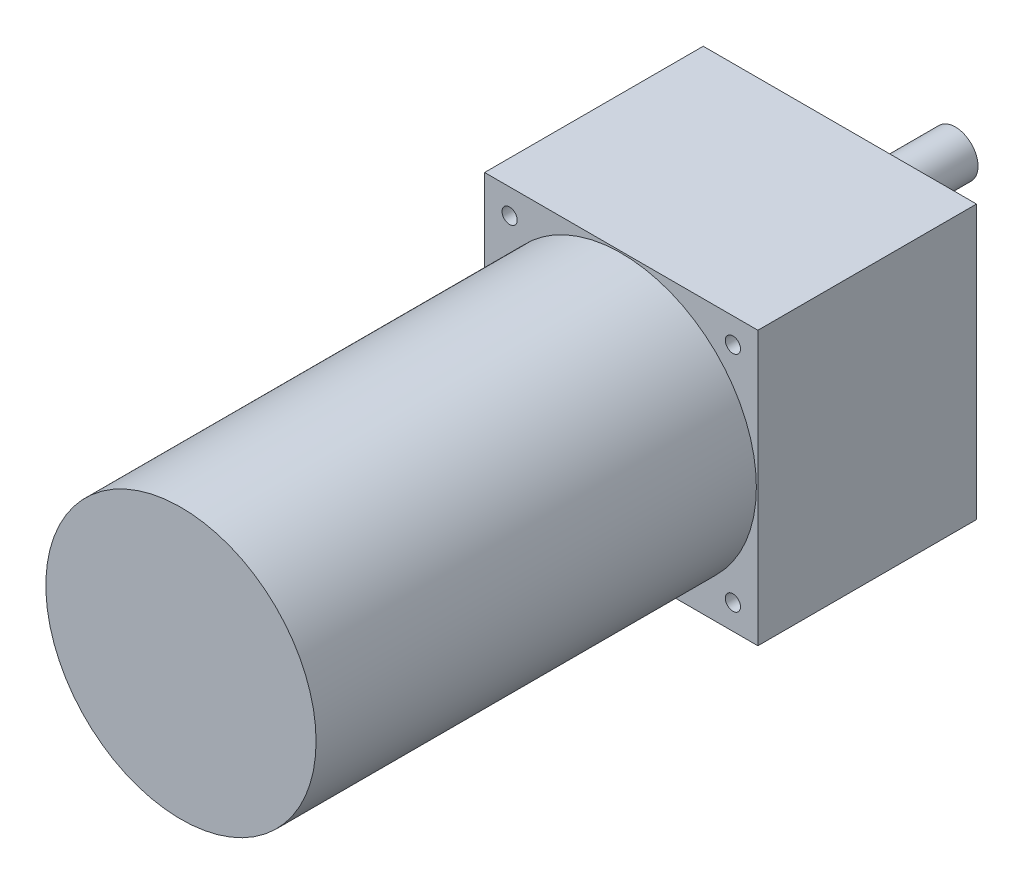
ISO-10303-21;
HEADER;
FILE_DESCRIPTION(('STEP AP214'),'2;1');
FILE_NAME('part.step','',(''),(''),'','','');
FILE_SCHEMA(('AUTOMOTIVE_DESIGN { 1 0 10303 214 1 1 1 1 }'));
ENDSEC;
DATA;
#1=APPLICATION_CONTEXT('core data for automotive mechanical design processes');
#2=APPLICATION_PROTOCOL_DEFINITION('international standard','automotive_design',2000,#1);
#3=PRODUCT_CONTEXT('',#1,'mechanical');
#4=PRODUCT('Part','Part','',(#3));
#5=PRODUCT_RELATED_PRODUCT_CATEGORY('part','',(#4));
#6=PRODUCT_DEFINITION_FORMATION('','',#4);
#7=PRODUCT_DEFINITION_CONTEXT('part definition',#1,'design');
#8=PRODUCT_DEFINITION('design','',#6,#7);
#9=PRODUCT_DEFINITION_SHAPE('','',#8);
#10=(LENGTH_UNIT() NAMED_UNIT(*) SI_UNIT(.MILLI.,.METRE.));
#11=(NAMED_UNIT(*) PLANE_ANGLE_UNIT() SI_UNIT($,.RADIAN.));
#12=(NAMED_UNIT(*) SI_UNIT($,.STERADIAN.) SOLID_ANGLE_UNIT());
#13=UNCERTAINTY_MEASURE_WITH_UNIT(LENGTH_MEASURE(1.E-05),#10,'distance_accuracy_value','');
#14=(GEOMETRIC_REPRESENTATION_CONTEXT(3) GLOBAL_UNCERTAINTY_ASSIGNED_CONTEXT((#13)) GLOBAL_UNIT_ASSIGNED_CONTEXT((#10,
#11,#12)) REPRESENTATION_CONTEXT('',''));
#15=CARTESIAN_POINT('',(0.,0.,0.));
#16=DIRECTION('',(0.,0.,1.));
#17=DIRECTION('',(1.,0.,0.));
#18=AXIS2_PLACEMENT_3D('',#15,#16,#17);
#19=CARTESIAN_POINT('',(45.,45.,7.));
#20=DIRECTION('',(-1.,0.,0.));
#21=DIRECTION('',(0.,-1.,0.));
#22=AXIS2_PLACEMENT_3D('',#19,#20,#21);
#23=PLANE('',#22);
#24=DIRECTION('',(0.,0.,-1.));
#25=VECTOR('',#24,1.);
#26=CARTESIAN_POINT('',(45.,-45.,7.));
#27=LINE('',#26,#25);
#28=CARTESIAN_POINT('',(45.,-45.,7.));
#29=VERTEX_POINT('',#28);
#30=CARTESIAN_POINT('',(45.,-45.,-65.));
#31=VERTEX_POINT('',#30);
#32=EDGE_CURVE('E120',#29,#31,#27,.T.);
#33=ORIENTED_EDGE('',*,*,#32,.T.);
#34=DIRECTION('',(0.,-1.,0.));
#35=VECTOR('',#34,1.);
#36=CARTESIAN_POINT('',(45.,45.,-65.));
#37=LINE('',#36,#35);
#38=CARTESIAN_POINT('',(45.,45.,-65.));
#39=VERTEX_POINT('',#38);
#40=EDGE_CURVE('E96',#39,#31,#37,.T.);
#41=ORIENTED_EDGE('',*,*,#40,.F.);
#42=DIRECTION('',(0.,0.,-1.));
#43=VECTOR('',#42,1.);
#44=CARTESIAN_POINT('',(45.,45.,7.));
#45=LINE('',#44,#43);
#46=CARTESIAN_POINT('',(45.,45.,7.));
#47=VERTEX_POINT('',#46);
#48=EDGE_CURVE('E47',#47,#39,#45,.T.);
#49=ORIENTED_EDGE('',*,*,#48,.F.);
#50=DIRECTION('',(0.,1.,0.));
#51=VECTOR('',#50,1.);
#52=CARTESIAN_POINT('',(45.,45.,7.));
#53=LINE('',#52,#51);
#54=EDGE_CURVE('E113',#29,#47,#53,.T.);
#55=ORIENTED_EDGE('',*,*,#54,.F.);
#56=EDGE_LOOP('',(#33,#41,#49,#55));
#57=FACE_BOUND('',#56,.T.);
#58=ADVANCED_FACE('F39',(#57),#23,.F.);
#59=CARTESIAN_POINT('',(-45.,45.,7.));
#60=DIRECTION('',(0.,-1.,0.));
#61=DIRECTION('',(0.,0.,-1.));
#62=AXIS2_PLACEMENT_3D('',#59,#60,#61);
#63=PLANE('',#62);
#64=ORIENTED_EDGE('',*,*,#48,.T.);
#65=DIRECTION('',(1.,0.,0.));
#66=VECTOR('',#65,1.);
#67=CARTESIAN_POINT('',(45.,45.,-65.));
#68=LINE('',#67,#66);
#69=CARTESIAN_POINT('',(-45.,45.,-65.));
#70=VERTEX_POINT('',#69);
#71=EDGE_CURVE('E90',#70,#39,#68,.T.);
#72=ORIENTED_EDGE('',*,*,#71,.F.);
#73=DIRECTION('',(0.,0.,-1.));
#74=VECTOR('',#73,1.);
#75=CARTESIAN_POINT('',(-45.,45.,7.));
#76=LINE('',#75,#74);
#77=CARTESIAN_POINT('',(-45.,45.,7.));
#78=VERTEX_POINT('',#77);
#79=EDGE_CURVE('E81',#78,#70,#76,.T.);
#80=ORIENTED_EDGE('',*,*,#79,.F.);
#81=DIRECTION('',(-1.,0.,0.));
#82=VECTOR('',#81,1.);
#83=CARTESIAN_POINT('',(-45.,45.,7.));
#84=LINE('',#83,#82);
#85=EDGE_CURVE('E116',#47,#78,#84,.T.);
#86=ORIENTED_EDGE('',*,*,#85,.F.);
#87=EDGE_LOOP('',(#64,#72,#80,#86));
#88=FACE_BOUND('',#87,.T.);
#89=ADVANCED_FACE('F91',(#88),#63,.F.);
#90=CARTESIAN_POINT('',(-45.,45.,7.));
#91=DIRECTION('',(1.,0.,0.));
#92=DIRECTION('',(0.,1.,0.));
#93=AXIS2_PLACEMENT_3D('',#90,#91,#92);
#94=PLANE('',#93);
#95=ORIENTED_EDGE('',*,*,#79,.T.);
#96=DIRECTION('',(0.,1.,0.));
#97=VECTOR('',#96,1.);
#98=CARTESIAN_POINT('',(-45.,45.,-65.));
#99=LINE('',#98,#97);
#100=CARTESIAN_POINT('',(-45.,-45.,-65.));
#101=VERTEX_POINT('',#100);
#102=EDGE_CURVE('E85',#101,#70,#99,.T.);
#103=ORIENTED_EDGE('',*,*,#102,.F.);
#104=DIRECTION('',(0.,0.,-1.));
#105=VECTOR('',#104,1.);
#106=CARTESIAN_POINT('',(-45.,-45.,7.));
#107=LINE('',#106,#105);
#108=CARTESIAN_POINT('',(-45.,-45.,7.));
#109=VERTEX_POINT('',#108);
#110=EDGE_CURVE('E87',#109,#101,#107,.T.);
#111=ORIENTED_EDGE('',*,*,#110,.F.);
#112=DIRECTION('',(0.,-1.,0.));
#113=VECTOR('',#112,1.);
#114=CARTESIAN_POINT('',(-45.,45.,7.));
#115=LINE('',#114,#113);
#116=EDGE_CURVE('E60',#78,#109,#115,.T.);
#117=ORIENTED_EDGE('',*,*,#116,.F.);
#118=EDGE_LOOP('',(#95,#103,#111,#117));
#119=FACE_BOUND('',#118,.T.);
#120=ADVANCED_FACE('F83',(#119),#94,.F.);
#121=CARTESIAN_POINT('',(-45.,-45.,7.));
#122=DIRECTION('',(0.,1.,0.));
#123=DIRECTION('',(0.,0.,1.));
#124=AXIS2_PLACEMENT_3D('',#121,#122,#123);
#125=PLANE('',#124);
#126=ORIENTED_EDGE('',*,*,#110,.T.);
#127=DIRECTION('',(-1.,0.,0.));
#128=VECTOR('',#127,1.);
#129=CARTESIAN_POINT('',(45.,-45.,-65.));
#130=LINE('',#129,#128);
#131=EDGE_CURVE('E101',#31,#101,#130,.T.);
#132=ORIENTED_EDGE('',*,*,#131,.F.);
#133=ORIENTED_EDGE('',*,*,#32,.F.);
#134=DIRECTION('',(1.,0.,0.));
#135=VECTOR('',#134,1.);
#136=CARTESIAN_POINT('',(-45.,-45.,7.));
#137=LINE('',#136,#135);
#138=EDGE_CURVE('E55',#109,#29,#137,.T.);
#139=ORIENTED_EDGE('',*,*,#138,.F.);
#140=EDGE_LOOP('',(#126,#132,#133,#139));
#141=FACE_BOUND('',#140,.T.);
#142=ADVANCED_FACE('F123',(#141),#125,.F.);
#143=CARTESIAN_POINT('',(0.,0.,7.));
#144=DIRECTION('',(0.,0.,1.));
#145=DIRECTION('',(1.,0.,0.));
#146=AXIS2_PLACEMENT_3D('',#143,#144,#145);
#147=PLANE('',#146);
#148=CARTESIAN_POINT('',(36.7695526217005,36.7695526217004,7.00000000000001));
#149=DIRECTION('',(0.,0.,1.));
#150=DIRECTION('',(1.,0.,0.));
#151=AXIS2_PLACEMENT_3D('',#148,#149,#150);
#152=CIRCLE('',#151,2.49999999999997);
#153=CARTESIAN_POINT('',(39.2695526217005,36.7695526217004,7.00000000000001));
#154=VERTEX_POINT('',#153);
#155=EDGE_CURVE('E299',#154,#154,#152,.T.);
#156=ORIENTED_EDGE('',*,*,#155,.F.);
#157=EDGE_LOOP('',(#156));
#158=FACE_BOUND('',#157,.T.);
#159=CARTESIAN_POINT('',(-36.7695526217005,36.7695526217004,7.00000000000001));
#160=DIRECTION('',(0.,0.,1.));
#161=DIRECTION('',(1.,0.,0.));
#162=AXIS2_PLACEMENT_3D('',#159,#160,#161);
#163=CIRCLE('',#162,2.49999999999997);
#164=CARTESIAN_POINT('',(-34.2695526217006,36.7695526217004,7.00000000000001));
#165=VERTEX_POINT('',#164);
#166=EDGE_CURVE('E42',#165,#165,#163,.T.);
#167=ORIENTED_EDGE('',*,*,#166,.F.);
#168=EDGE_LOOP('',(#167));
#169=FACE_BOUND('',#168,.T.);
#170=CARTESIAN_POINT('',(-36.7695526217008,-36.7695526217001,7.00000000000001));
#171=DIRECTION('',(0.,0.,1.));
#172=DIRECTION('',(1.,0.,0.));
#173=AXIS2_PLACEMENT_3D('',#170,#171,#172);
#174=CIRCLE('',#173,2.49999999999997);
#175=CARTESIAN_POINT('',(-34.2695526217008,-36.7695526217001,7.00000000000001));
#176=VERTEX_POINT('',#175);
#177=EDGE_CURVE('E312',#176,#176,#174,.T.);
#178=ORIENTED_EDGE('',*,*,#177,.F.);
#179=EDGE_LOOP('',(#178));
#180=FACE_BOUND('',#179,.T.);
#181=CARTESIAN_POINT('',(36.7695526217003,-36.7695526217007,7.00000000000001));
#182=DIRECTION('',(0.,0.,1.));
#183=DIRECTION('',(1.,0.,0.));
#184=AXIS2_PLACEMENT_3D('',#181,#182,#183);
#185=CIRCLE('',#184,2.49999999999997);
#186=CARTESIAN_POINT('',(39.2695526217002,-36.7695526217007,7.00000000000001));
#187=VERTEX_POINT('',#186);
#188=EDGE_CURVE('E318',#187,#187,#185,.T.);
#189=ORIENTED_EDGE('',*,*,#188,.F.);
#190=EDGE_LOOP('',(#189));
#191=FACE_BOUND('',#190,.T.);
#192=CARTESIAN_POINT('',(0.,0.,7.));
#193=DIRECTION('',(0.,0.,1.));
#194=DIRECTION('',(1.,0.,0.));
#195=AXIS2_PLACEMENT_3D('',#192,#193,#194);
#196=CIRCLE('',#195,44.5);
#197=CARTESIAN_POINT('',(44.5,0.,7.));
#198=VERTEX_POINT('',#197);
#199=EDGE_CURVE('E11',#198,#198,#196,.T.);
#200=ORIENTED_EDGE('',*,*,#199,.F.);
#201=EDGE_LOOP('',(#200));
#202=FACE_BOUND('',#201,.T.);
#203=ORIENTED_EDGE('',*,*,#54,.T.);
#204=ORIENTED_EDGE('',*,*,#85,.T.);
#205=ORIENTED_EDGE('',*,*,#116,.T.);
#206=ORIENTED_EDGE('',*,*,#138,.T.);
#207=EDGE_LOOP('',(#203,#204,#205,#206));
#208=FACE_BOUND('',#207,.T.);
#209=ADVANCED_FACE('F126',(#158,#169,#180,#191,#202,#208),#147,.T.);
#210=CARTESIAN_POINT('',(0.,0.,152.));
#211=DIRECTION('',(0.,0.,-1.));
#212=DIRECTION('',(-1.,0.,0.));
#213=AXIS2_PLACEMENT_3D('',#210,#211,#212);
#214=CYLINDRICAL_SURFACE('',#213,44.5);
#215=CARTESIAN_POINT('',(0.,0.,152.));
#216=DIRECTION('',(0.,0.,1.));
#217=DIRECTION('',(1.,0.,0.));
#218=AXIS2_PLACEMENT_3D('',#215,#216,#217);
#219=CIRCLE('',#218,44.5);
#220=CARTESIAN_POINT('',(44.5,0.,152.));
#221=VERTEX_POINT('',#220);
#222=EDGE_CURVE('E111',#221,#221,#219,.T.);
#223=ORIENTED_EDGE('',*,*,#222,.F.);
#224=EDGE_LOOP('',(#223));
#225=FACE_BOUND('',#224,.T.);
#226=ORIENTED_EDGE('',*,*,#199,.T.);
#227=EDGE_LOOP('',(#226));
#228=FACE_BOUND('',#227,.T.);
#229=ADVANCED_FACE('F128',(#225,#228),#214,.T.);
#230=CARTESIAN_POINT('',(0.,0.,152.));
#231=DIRECTION('',(0.,0.,1.));
#232=DIRECTION('',(1.,0.,0.));
#233=AXIS2_PLACEMENT_3D('',#230,#231,#232);
#234=PLANE('',#233);
#235=ORIENTED_EDGE('',*,*,#222,.T.);
#236=EDGE_LOOP('',(#235));
#237=FACE_BOUND('',#236,.T.);
#238=ADVANCED_FACE('F135',(#237),#234,.T.);
#239=CARTESIAN_POINT('',(0.,0.,-65.));
#240=DIRECTION('',(0.,0.,-1.));
#241=DIRECTION('',(-1.,0.,0.));
#242=AXIS2_PLACEMENT_3D('',#239,#240,#241);
#243=PLANE('',#242);
#244=CARTESIAN_POINT('',(36.7695526217005,36.7695526217004,-65.));
#245=DIRECTION('',(0.,0.,-1.));
#246=DIRECTION('',(-1.,0.,0.));
#247=AXIS2_PLACEMENT_3D('',#244,#245,#246);
#248=CIRCLE('',#247,2.49999999999999);
#249=CARTESIAN_POINT('',(34.2695526217005,36.7695526217004,-65.));
#250=VERTEX_POINT('',#249);
#251=EDGE_CURVE('E302',#250,#250,#248,.T.);
#252=ORIENTED_EDGE('',*,*,#251,.F.);
#253=EDGE_LOOP('',(#252));
#254=FACE_BOUND('',#253,.T.);
#255=CARTESIAN_POINT('',(-36.7695526217005,36.7695526217004,-65.));
#256=DIRECTION('',(0.,0.,-1.));
#257=DIRECTION('',(-1.,0.,0.));
#258=AXIS2_PLACEMENT_3D('',#255,#256,#257);
#259=CIRCLE('',#258,2.49999999999999);
#260=CARTESIAN_POINT('',(-39.2695526217005,36.7695526217004,-65.));
#261=VERTEX_POINT('',#260);
#262=EDGE_CURVE('E304',#261,#261,#259,.T.);
#263=ORIENTED_EDGE('',*,*,#262,.F.);
#264=EDGE_LOOP('',(#263));
#265=FACE_BOUND('',#264,.T.);
#266=CARTESIAN_POINT('',(-36.7695526217008,-36.7695526217001,-65.));
#267=DIRECTION('',(0.,0.,-1.));
#268=DIRECTION('',(-1.,0.,0.));
#269=AXIS2_PLACEMENT_3D('',#266,#267,#268);
#270=CIRCLE('',#269,2.49999999999999);
#271=CARTESIAN_POINT('',(-39.2695526217008,-36.7695526217001,-65.));
#272=VERTEX_POINT('',#271);
#273=EDGE_CURVE('E309',#272,#272,#270,.T.);
#274=ORIENTED_EDGE('',*,*,#273,.F.);
#275=EDGE_LOOP('',(#274));
#276=FACE_BOUND('',#275,.T.);
#277=CARTESIAN_POINT('',(36.7695526217003,-36.7695526217007,-65.));
#278=DIRECTION('',(0.,0.,-1.));
#279=DIRECTION('',(-1.,0.,0.));
#280=AXIS2_PLACEMENT_3D('',#277,#278,#279);
#281=CIRCLE('',#280,2.49999999999999);
#282=CARTESIAN_POINT('',(34.2695526217003,-36.7695526217007,-65.));
#283=VERTEX_POINT('',#282);
#284=EDGE_CURVE('E315',#283,#283,#281,.T.);
#285=ORIENTED_EDGE('',*,*,#284,.F.);
#286=EDGE_LOOP('',(#285));
#287=FACE_BOUND('',#286,.T.);
#288=CARTESIAN_POINT('',(0.,18.,-65.));
#289=DIRECTION('',(0.,0.,-1.));
#290=DIRECTION('',(-1.,0.,0.));
#291=AXIS2_PLACEMENT_3D('',#288,#289,#290);
#292=CIRCLE('',#291,7.5);
#293=CARTESIAN_POINT('',(-7.5,18.,-65.));
#294=VERTEX_POINT('',#293);
#295=EDGE_CURVE('E105',#294,#294,#292,.T.);
#296=ORIENTED_EDGE('',*,*,#295,.F.);
#297=EDGE_LOOP('',(#296));
#298=FACE_BOUND('',#297,.T.);
#299=ORIENTED_EDGE('',*,*,#102,.T.);
#300=ORIENTED_EDGE('',*,*,#71,.T.);
#301=ORIENTED_EDGE('',*,*,#40,.T.);
#302=ORIENTED_EDGE('',*,*,#131,.T.);
#303=EDGE_LOOP('',(#299,#300,#301,#302));
#304=FACE_BOUND('',#303,.T.);
#305=ADVANCED_FACE('F99',(#254,#265,#276,#287,#298,#304),#243,.T.);
#306=CARTESIAN_POINT('',(0.,18.,-103.));
#307=DIRECTION('',(0.,0.,1.));
#308=DIRECTION('',(1.,0.,0.));
#309=AXIS2_PLACEMENT_3D('',#306,#307,#308);
#310=CYLINDRICAL_SURFACE('',#309,7.5);
#311=CARTESIAN_POINT('',(0.,18.,-103.));
#312=DIRECTION('',(0.,0.,-1.));
#313=DIRECTION('',(-1.,0.,0.));
#314=AXIS2_PLACEMENT_3D('',#311,#312,#313);
#315=CIRCLE('',#314,7.5);
#316=CARTESIAN_POINT('',(-7.5,18.,-103.));
#317=VERTEX_POINT('',#316);
#318=EDGE_CURVE('E102',#317,#317,#315,.T.);
#319=ORIENTED_EDGE('',*,*,#318,.F.);
#320=EDGE_LOOP('',(#319));
#321=FACE_BOUND('',#320,.T.);
#322=ORIENTED_EDGE('',*,*,#295,.T.);
#323=EDGE_LOOP('',(#322));
#324=FACE_BOUND('',#323,.T.);
#325=ADVANCED_FACE('F162',(#321,#324),#310,.T.);
#326=CARTESIAN_POINT('',(0.,18.,-103.));
#327=DIRECTION('',(0.,0.,-1.));
#328=DIRECTION('',(-1.,0.,0.));
#329=AXIS2_PLACEMENT_3D('',#326,#327,#328);
#330=PLANE('',#329);
#331=ORIENTED_EDGE('',*,*,#318,.T.);
#332=EDGE_LOOP('',(#331));
#333=FACE_BOUND('',#332,.T.);
#334=ADVANCED_FACE('F167',(#333),#330,.T.);
#335=CARTESIAN_POINT('',(36.7695526217003,-36.7695526217007,-65.));
#336=DIRECTION('',(0.,0.,-1.));
#337=DIRECTION('',(-1.,0.,0.));
#338=AXIS2_PLACEMENT_3D('',#335,#336,#337);
#339=CYLINDRICAL_SURFACE('',#338,2.49999999999997);
#340=ORIENTED_EDGE('',*,*,#188,.T.);
#341=EDGE_LOOP('',(#340));
#342=FACE_BOUND('',#341,.T.);
#343=ORIENTED_EDGE('',*,*,#284,.T.);
#344=EDGE_LOOP('',(#343));
#345=FACE_BOUND('',#344,.T.);
#346=ADVANCED_FACE('F177',(#342,#345),#339,.F.);
#347=CARTESIAN_POINT('',(-36.7695526217008,-36.7695526217001,-65.));
#348=DIRECTION('',(0.,0.,-1.));
#349=DIRECTION('',(-1.,0.,0.));
#350=AXIS2_PLACEMENT_3D('',#347,#348,#349);
#351=CYLINDRICAL_SURFACE('',#350,2.49999999999997);
#352=ORIENTED_EDGE('',*,*,#177,.T.);
#353=EDGE_LOOP('',(#352));
#354=FACE_BOUND('',#353,.T.);
#355=ORIENTED_EDGE('',*,*,#273,.T.);
#356=EDGE_LOOP('',(#355));
#357=FACE_BOUND('',#356,.T.);
#358=ADVANCED_FACE('F204',(#354,#357),#351,.F.);
#359=CARTESIAN_POINT('',(-36.7695526217005,36.7695526217004,-65.));
#360=DIRECTION('',(0.,0.,-1.));
#361=DIRECTION('',(-1.,0.,0.));
#362=AXIS2_PLACEMENT_3D('',#359,#360,#361);
#363=CYLINDRICAL_SURFACE('',#362,2.49999999999997);
#364=ORIENTED_EDGE('',*,*,#166,.T.);
#365=EDGE_LOOP('',(#364));
#366=FACE_BOUND('',#365,.T.);
#367=ORIENTED_EDGE('',*,*,#262,.T.);
#368=EDGE_LOOP('',(#367));
#369=FACE_BOUND('',#368,.T.);
#370=ADVANCED_FACE('F215',(#366,#369),#363,.F.);
#371=CARTESIAN_POINT('',(36.7695526217005,36.7695526217004,-65.));
#372=DIRECTION('',(0.,0.,-1.));
#373=DIRECTION('',(-1.,0.,0.));
#374=AXIS2_PLACEMENT_3D('',#371,#372,#373);
#375=CYLINDRICAL_SURFACE('',#374,2.49999999999997);
#376=ORIENTED_EDGE('',*,*,#155,.T.);
#377=EDGE_LOOP('',(#376));
#378=FACE_BOUND('',#377,.T.);
#379=ORIENTED_EDGE('',*,*,#251,.T.);
#380=EDGE_LOOP('',(#379));
#381=FACE_BOUND('',#380,.T.);
#382=ADVANCED_FACE('F227',(#378,#381),#375,.F.);
#383=CLOSED_SHELL('',(#58,#89,#120,#142,#209,#229,#238,#305,#325,#334,#346,#358,#370,#382));
#384=MANIFOLD_SOLID_BREP('B2',#383);
#385=ADVANCED_BREP_SHAPE_REPRESENTATION('',(#18,#384),#14);
#386=SHAPE_DEFINITION_REPRESENTATION(#9,#385);
ENDSEC;
END-ISO-10303-21;
